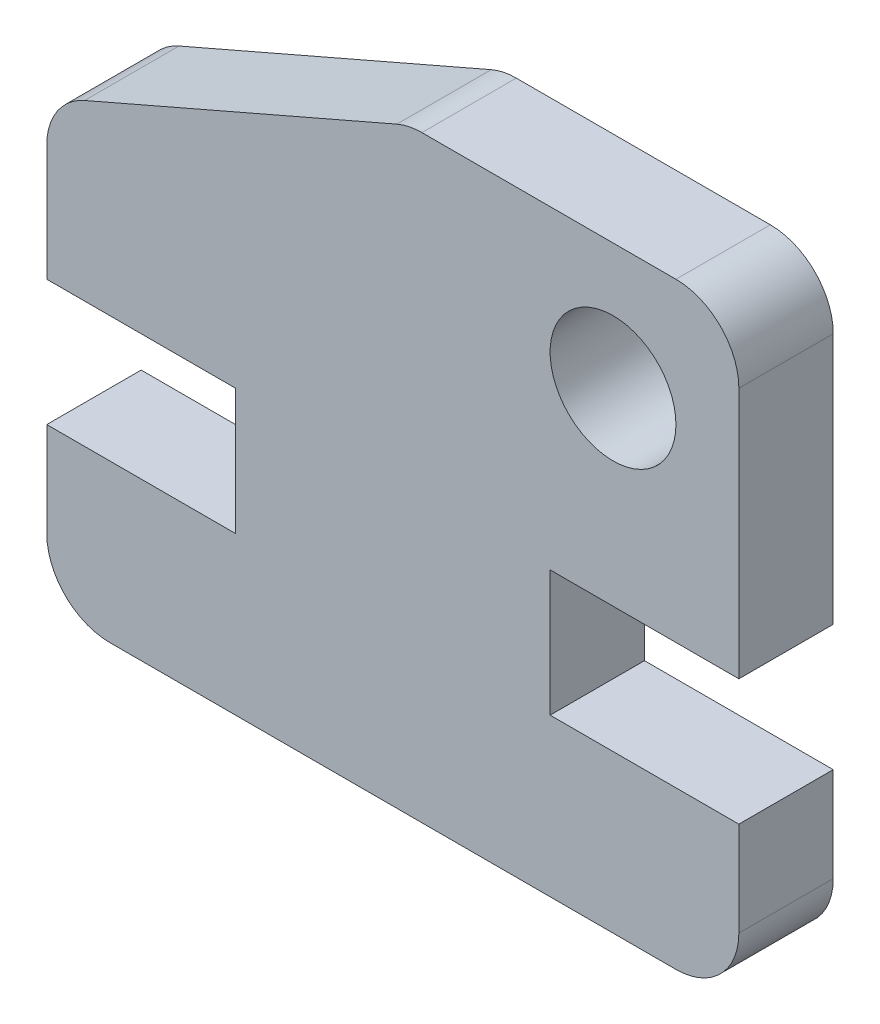
ISO-10303-21;
HEADER;
FILE_DESCRIPTION(('STEP AP214'),'2;1');
FILE_NAME('part.step','',(''),(''),'','','');
FILE_SCHEMA(('AUTOMOTIVE_DESIGN { 1 0 10303 214 1 1 1 1 }'));
ENDSEC;
DATA;
#1=APPLICATION_CONTEXT('core data for automotive mechanical design processes');
#2=APPLICATION_PROTOCOL_DEFINITION('international standard','automotive_design',2000,#1);
#3=PRODUCT_CONTEXT('',#1,'mechanical');
#4=PRODUCT('Part','Part','',(#3));
#5=PRODUCT_RELATED_PRODUCT_CATEGORY('part','',(#4));
#6=PRODUCT_DEFINITION_FORMATION('','',#4);
#7=PRODUCT_DEFINITION_CONTEXT('part definition',#1,'design');
#8=PRODUCT_DEFINITION('design','',#6,#7);
#9=PRODUCT_DEFINITION_SHAPE('','',#8);
#10=(LENGTH_UNIT() NAMED_UNIT(*) SI_UNIT(.MILLI.,.METRE.));
#11=(NAMED_UNIT(*) PLANE_ANGLE_UNIT() SI_UNIT($,.RADIAN.));
#12=(NAMED_UNIT(*) SI_UNIT($,.STERADIAN.) SOLID_ANGLE_UNIT());
#13=UNCERTAINTY_MEASURE_WITH_UNIT(LENGTH_MEASURE(1.E-05),#10,'distance_accuracy_value','');
#14=(GEOMETRIC_REPRESENTATION_CONTEXT(3) GLOBAL_UNCERTAINTY_ASSIGNED_CONTEXT((#13)) GLOBAL_UNIT_ASSIGNED_CONTEXT((#10,
#11,#12)) REPRESENTATION_CONTEXT('',''));
#15=CARTESIAN_POINT('',(0.,0.,0.));
#16=DIRECTION('',(0.,0.,1.));
#17=DIRECTION('',(1.,0.,0.));
#18=AXIS2_PLACEMENT_3D('',#15,#16,#17);
#19=CARTESIAN_POINT('',(-5.,5.,3.));
#20=DIRECTION('',(0.,-1.,0.));
#21=DIRECTION('',(0.,0.,-1.));
#22=AXIS2_PLACEMENT_3D('',#19,#20,#21);
#23=PLANE('',#22);
#24=DIRECTION('',(-1.,0.,0.));
#25=VECTOR('',#24,1.);
#26=CARTESIAN_POINT('',(-5.,5.,0.));
#27=LINE('',#26,#25);
#28=CARTESIAN_POINT('',(-5.,5.,0.));
#29=VERTEX_POINT('',#28);
#30=CARTESIAN_POINT('',(-11.,5.,0.));
#31=VERTEX_POINT('',#30);
#32=EDGE_CURVE('E183',#29,#31,#27,.T.);
#33=ORIENTED_EDGE('',*,*,#32,.T.);
#34=DIRECTION('',(0.,0.,-1.));
#35=VECTOR('',#34,1.);
#36=CARTESIAN_POINT('',(-11.,5.,3.));
#37=LINE('',#36,#35);
#38=CARTESIAN_POINT('',(-11.,5.,3.));
#39=VERTEX_POINT('',#38);
#40=EDGE_CURVE('E162',#39,#31,#37,.T.);
#41=ORIENTED_EDGE('',*,*,#40,.F.);
#42=DIRECTION('',(-1.,0.,0.));
#43=VECTOR('',#42,1.);
#44=CARTESIAN_POINT('',(-5.,5.,3.));
#45=LINE('',#44,#43);
#46=CARTESIAN_POINT('',(-5.,5.,3.));
#47=VERTEX_POINT('',#46);
#48=EDGE_CURVE('E169',#47,#39,#45,.T.);
#49=ORIENTED_EDGE('',*,*,#48,.F.);
#50=DIRECTION('',(0.,0.,-1.));
#51=VECTOR('',#50,1.);
#52=CARTESIAN_POINT('',(-5.,5.,3.));
#53=LINE('',#52,#51);
#54=EDGE_CURVE('E264',#47,#29,#53,.T.);
#55=ORIENTED_EDGE('',*,*,#54,.T.);
#56=EDGE_LOOP('',(#33,#41,#49,#55));
#57=FACE_BOUND('',#56,.T.);
#58=ADVANCED_FACE('F35',(#57),#23,.F.);
#59=CARTESIAN_POINT('',(-11.,5.,3.));
#60=DIRECTION('',(1.,0.,0.));
#61=DIRECTION('',(0.,1.,0.));
#62=AXIS2_PLACEMENT_3D('',#59,#60,#61);
#63=PLANE('',#62);
#64=DIRECTION('',(0.,-1.,0.));
#65=VECTOR('',#64,1.);
#66=CARTESIAN_POINT('',(-11.,5.,0.));
#67=LINE('',#66,#65);
#68=CARTESIAN_POINT('',(-11.,2.,0.));
#69=VERTEX_POINT('',#68);
#70=EDGE_CURVE('E246',#31,#69,#67,.T.);
#71=ORIENTED_EDGE('',*,*,#70,.T.);
#72=DIRECTION('',(0.,0.,-1.));
#73=VECTOR('',#72,1.);
#74=CARTESIAN_POINT('',(-11.,2.,3.));
#75=LINE('',#74,#73);
#76=CARTESIAN_POINT('',(-11.,2.,3.));
#77=VERTEX_POINT('',#76);
#78=EDGE_CURVE('E165',#69,#77,#75,.F.);
#79=ORIENTED_EDGE('',*,*,#78,.T.);
#80=DIRECTION('',(0.,-1.,0.));
#81=VECTOR('',#80,1.);
#82=CARTESIAN_POINT('',(-11.,5.,3.));
#83=LINE('',#82,#81);
#84=EDGE_CURVE('E158',#39,#77,#83,.T.);
#85=ORIENTED_EDGE('',*,*,#84,.F.);
#86=ORIENTED_EDGE('',*,*,#40,.T.);
#87=EDGE_LOOP('',(#71,#79,#85,#86));
#88=FACE_BOUND('',#87,.T.);
#89=ADVANCED_FACE('F160',(#88),#63,.F.);
#90=CARTESIAN_POINT('',(-11.,0.,3.));
#91=DIRECTION('',(0.,1.,0.));
#92=DIRECTION('',(0.,0.,1.));
#93=AXIS2_PLACEMENT_3D('',#90,#91,#92);
#94=PLANE('',#93);
#95=DIRECTION('',(1.,0.,0.));
#96=VECTOR('',#95,1.);
#97=CARTESIAN_POINT('',(-11.,0.,3.));
#98=LINE('',#97,#96);
#99=CARTESIAN_POINT('',(-9.,0.,3.));
#100=VERTEX_POINT('',#99);
#101=CARTESIAN_POINT('',(9.,0.,3.));
#102=VERTEX_POINT('',#101);
#103=EDGE_CURVE('E168',#100,#102,#98,.T.);
#104=ORIENTED_EDGE('',*,*,#103,.F.);
#105=DIRECTION('',(0.,0.,-1.));
#106=VECTOR('',#105,1.);
#107=CARTESIAN_POINT('',(-9.,0.,3.));
#108=LINE('',#107,#106);
#109=CARTESIAN_POINT('',(-9.,0.,0.));
#110=VERTEX_POINT('',#109);
#111=EDGE_CURVE('E224',#100,#110,#108,.T.);
#112=ORIENTED_EDGE('',*,*,#111,.T.);
#113=DIRECTION('',(1.,0.,0.));
#114=VECTOR('',#113,1.);
#115=CARTESIAN_POINT('',(-11.,0.,0.));
#116=LINE('',#115,#114);
#117=CARTESIAN_POINT('',(9.,0.,0.));
#118=VERTEX_POINT('',#117);
#119=EDGE_CURVE('E242',#110,#118,#116,.T.);
#120=ORIENTED_EDGE('',*,*,#119,.T.);
#121=DIRECTION('',(0.,0.,-1.));
#122=VECTOR('',#121,1.);
#123=CARTESIAN_POINT('',(9.,0.,3.));
#124=LINE('',#123,#122);
#125=EDGE_CURVE('E222',#118,#102,#124,.F.);
#126=ORIENTED_EDGE('',*,*,#125,.T.);
#127=EDGE_LOOP('',(#104,#112,#120,#126));
#128=FACE_BOUND('',#127,.T.);
#129=ADVANCED_FACE('F318',(#128),#94,.F.);
#130=CARTESIAN_POINT('',(11.,5.,3.));
#131=DIRECTION('',(-1.,0.,0.));
#132=DIRECTION('',(0.,-1.,0.));
#133=AXIS2_PLACEMENT_3D('',#130,#131,#132);
#134=PLANE('',#133);
#135=DIRECTION('',(0.,1.,0.));
#136=VECTOR('',#135,1.);
#137=CARTESIAN_POINT('',(11.,5.,3.));
#138=LINE('',#137,#136);
#139=CARTESIAN_POINT('',(11.,2.,3.));
#140=VERTEX_POINT('',#139);
#141=CARTESIAN_POINT('',(11.,5.,3.));
#142=VERTEX_POINT('',#141);
#143=EDGE_CURVE('E234',#140,#142,#138,.T.);
#144=ORIENTED_EDGE('',*,*,#143,.F.);
#145=DIRECTION('',(0.,0.,-1.));
#146=VECTOR('',#145,1.);
#147=CARTESIAN_POINT('',(11.,2.,3.));
#148=LINE('',#147,#146);
#149=CARTESIAN_POINT('',(11.,2.,0.));
#150=VERTEX_POINT('',#149);
#151=EDGE_CURVE('E43',#140,#150,#148,.T.);
#152=ORIENTED_EDGE('',*,*,#151,.T.);
#153=DIRECTION('',(0.,1.,0.));
#154=VECTOR('',#153,1.);
#155=CARTESIAN_POINT('',(11.,5.,0.));
#156=LINE('',#155,#154);
#157=CARTESIAN_POINT('',(11.,5.,0.));
#158=VERTEX_POINT('',#157);
#159=EDGE_CURVE('E233',#150,#158,#156,.T.);
#160=ORIENTED_EDGE('',*,*,#159,.T.);
#161=DIRECTION('',(0.,0.,-1.));
#162=VECTOR('',#161,1.);
#163=CARTESIAN_POINT('',(11.,5.,3.));
#164=LINE('',#163,#162);
#165=EDGE_CURVE('E185',#142,#158,#164,.T.);
#166=ORIENTED_EDGE('',*,*,#165,.F.);
#167=EDGE_LOOP('',(#144,#152,#160,#166));
#168=FACE_BOUND('',#167,.T.);
#169=ADVANCED_FACE('F231',(#168),#134,.F.);
#170=CARTESIAN_POINT('',(5.,5.,3.));
#171=DIRECTION('',(0.,-1.,0.));
#172=DIRECTION('',(0.,0.,-1.));
#173=AXIS2_PLACEMENT_3D('',#170,#171,#172);
#174=PLANE('',#173);
#175=DIRECTION('',(-1.,0.,0.));
#176=VECTOR('',#175,1.);
#177=CARTESIAN_POINT('',(5.,5.,0.));
#178=LINE('',#177,#176);
#179=CARTESIAN_POINT('',(5.,5.,0.));
#180=VERTEX_POINT('',#179);
#181=EDGE_CURVE('E241',#158,#180,#178,.T.);
#182=ORIENTED_EDGE('',*,*,#181,.T.);
#183=DIRECTION('',(0.,0.,-1.));
#184=VECTOR('',#183,1.);
#185=CARTESIAN_POINT('',(5.,5.,3.));
#186=LINE('',#185,#184);
#187=CARTESIAN_POINT('',(5.,5.,3.));
#188=VERTEX_POINT('',#187);
#189=EDGE_CURVE('E191',#188,#180,#186,.T.);
#190=ORIENTED_EDGE('',*,*,#189,.F.);
#191=DIRECTION('',(-1.,0.,0.));
#192=VECTOR('',#191,1.);
#193=CARTESIAN_POINT('',(5.,5.,3.));
#194=LINE('',#193,#192);
#195=EDGE_CURVE('E321',#142,#188,#194,.T.);
#196=ORIENTED_EDGE('',*,*,#195,.F.);
#197=ORIENTED_EDGE('',*,*,#165,.T.);
#198=EDGE_LOOP('',(#182,#190,#196,#197));
#199=FACE_BOUND('',#198,.T.);
#200=ADVANCED_FACE('F324',(#199),#174,.F.);
#201=CARTESIAN_POINT('',(5.,9.,3.));
#202=DIRECTION('',(-1.,0.,0.));
#203=DIRECTION('',(0.,0.,1.));
#204=AXIS2_PLACEMENT_3D('',#201,#202,#203);
#205=PLANE('',#204);
#206=DIRECTION('',(0.,1.,0.));
#207=VECTOR('',#206,1.);
#208=CARTESIAN_POINT('',(5.,9.,0.));
#209=LINE('',#208,#207);
#210=CARTESIAN_POINT('',(5.,9.,0.));
#211=VERTEX_POINT('',#210);
#212=EDGE_CURVE('E244',#180,#211,#209,.T.);
#213=ORIENTED_EDGE('',*,*,#212,.T.);
#214=DIRECTION('',(0.,0.,-1.));
#215=VECTOR('',#214,1.);
#216=CARTESIAN_POINT('',(5.,9.,3.));
#217=LINE('',#216,#215);
#218=CARTESIAN_POINT('',(5.,9.,3.));
#219=VERTEX_POINT('',#218);
#220=EDGE_CURVE('E275',#219,#211,#217,.T.);
#221=ORIENTED_EDGE('',*,*,#220,.F.);
#222=DIRECTION('',(0.,1.,0.));
#223=VECTOR('',#222,1.);
#224=CARTESIAN_POINT('',(5.,9.,3.));
#225=LINE('',#224,#223);
#226=EDGE_CURVE('E283',#188,#219,#225,.T.);
#227=ORIENTED_EDGE('',*,*,#226,.F.);
#228=ORIENTED_EDGE('',*,*,#189,.T.);
#229=EDGE_LOOP('',(#213,#221,#227,#228));
#230=FACE_BOUND('',#229,.T.);
#231=ADVANCED_FACE('F281',(#230),#205,.F.);
#232=CARTESIAN_POINT('',(5.,9.,3.));
#233=DIRECTION('',(0.,1.,0.));
#234=DIRECTION('',(0.,0.,1.));
#235=AXIS2_PLACEMENT_3D('',#232,#233,#234);
#236=PLANE('',#235);
#237=DIRECTION('',(1.,0.,0.));
#238=VECTOR('',#237,1.);
#239=CARTESIAN_POINT('',(5.,9.,0.));
#240=LINE('',#239,#238);
#241=CARTESIAN_POINT('',(11.,9.,0.));
#242=VERTEX_POINT('',#241);
#243=EDGE_CURVE('E251',#211,#242,#240,.T.);
#244=ORIENTED_EDGE('',*,*,#243,.T.);
#245=DIRECTION('',(0.,0.,-1.));
#246=VECTOR('',#245,1.);
#247=CARTESIAN_POINT('',(11.,9.,3.));
#248=LINE('',#247,#246);
#249=CARTESIAN_POINT('',(11.,9.,3.));
#250=VERTEX_POINT('',#249);
#251=EDGE_CURVE('E272',#250,#242,#248,.T.);
#252=ORIENTED_EDGE('',*,*,#251,.F.);
#253=DIRECTION('',(1.,0.,0.));
#254=VECTOR('',#253,1.);
#255=CARTESIAN_POINT('',(5.,9.,3.));
#256=LINE('',#255,#254);
#257=EDGE_CURVE('E300',#219,#250,#256,.T.);
#258=ORIENTED_EDGE('',*,*,#257,.F.);
#259=ORIENTED_EDGE('',*,*,#220,.T.);
#260=EDGE_LOOP('',(#244,#252,#258,#259));
#261=FACE_BOUND('',#260,.T.);
#262=ADVANCED_FACE('F290',(#261),#236,.F.);
#263=CARTESIAN_POINT('',(11.,19.,3.));
#264=DIRECTION('',(-1.,0.,0.));
#265=DIRECTION('',(0.,0.,1.));
#266=AXIS2_PLACEMENT_3D('',#263,#264,#265);
#267=PLANE('',#266);
#268=DIRECTION('',(0.,1.,0.));
#269=VECTOR('',#268,1.);
#270=CARTESIAN_POINT('',(11.,19.,0.));
#271=LINE('',#270,#269);
#272=CARTESIAN_POINT('',(11.,17.,0.));
#273=VERTEX_POINT('',#272);
#274=EDGE_CURVE('E253',#242,#273,#271,.T.);
#275=ORIENTED_EDGE('',*,*,#274,.T.);
#276=DIRECTION('',(0.,0.,-1.));
#277=VECTOR('',#276,1.);
#278=CARTESIAN_POINT('',(11.,17.,3.));
#279=LINE('',#278,#277);
#280=CARTESIAN_POINT('',(11.,17.,3.));
#281=VERTEX_POINT('',#280);
#282=EDGE_CURVE('E11',#273,#281,#279,.F.);
#283=ORIENTED_EDGE('',*,*,#282,.T.);
#284=DIRECTION('',(0.,1.,0.));
#285=VECTOR('',#284,1.);
#286=CARTESIAN_POINT('',(11.,19.,3.));
#287=LINE('',#286,#285);
#288=EDGE_CURVE('E297',#250,#281,#287,.T.);
#289=ORIENTED_EDGE('',*,*,#288,.F.);
#290=ORIENTED_EDGE('',*,*,#251,.T.);
#291=EDGE_LOOP('',(#275,#283,#289,#290));
#292=FACE_BOUND('',#291,.T.);
#293=ADVANCED_FACE('F294',(#292),#267,.F.);
#294=CARTESIAN_POINT('',(-11.,19.,3.));
#295=DIRECTION('',(0.,-1.,0.));
#296=DIRECTION('',(0.,0.,-1.));
#297=AXIS2_PLACEMENT_3D('',#294,#295,#296);
#298=PLANE('',#297);
#299=DIRECTION('',(-1.,0.,0.));
#300=VECTOR('',#299,1.);
#301=CARTESIAN_POINT('',(-11.,19.,0.));
#302=LINE('',#301,#300);
#303=CARTESIAN_POINT('',(9.,19.,0.));
#304=VERTEX_POINT('',#303);
#305=CARTESIAN_POINT('',(0.92509029243301,19.,0.));
#306=VERTEX_POINT('',#305);
#307=EDGE_CURVE('E256',#304,#306,#302,.T.);
#308=ORIENTED_EDGE('',*,*,#307,.T.);
#309=DIRECTION('',(0.,0.,1.));
#310=VECTOR('',#309,1.);
#311=CARTESIAN_POINT('',(0.92509029243301,19.,3.));
#312=LINE('',#311,#310);
#313=CARTESIAN_POINT('',(0.92509029243301,19.,3.));
#314=VERTEX_POINT('',#313);
#315=EDGE_CURVE('E188',#306,#314,#312,.T.);
#316=ORIENTED_EDGE('',*,*,#315,.T.);
#317=DIRECTION('',(-1.,0.,0.));
#318=VECTOR('',#317,1.);
#319=CARTESIAN_POINT('',(-11.,19.,3.));
#320=LINE('',#319,#318);
#321=CARTESIAN_POINT('',(9.,19.,3.));
#322=VERTEX_POINT('',#321);
#323=EDGE_CURVE('E299',#322,#314,#320,.T.);
#324=ORIENTED_EDGE('',*,*,#323,.F.);
#325=DIRECTION('',(0.,0.,-1.));
#326=VECTOR('',#325,1.);
#327=CARTESIAN_POINT('',(9.,19.,3.));
#328=LINE('',#327,#326);
#329=EDGE_CURVE('E184',#322,#304,#328,.T.);
#330=ORIENTED_EDGE('',*,*,#329,.T.);
#331=EDGE_LOOP('',(#308,#316,#324,#330));
#332=FACE_BOUND('',#331,.T.);
#333=ADVANCED_FACE('F362',(#332),#298,.F.);
#334=CARTESIAN_POINT('',(-11.,19.,3.));
#335=DIRECTION('',(1.,0.,0.));
#336=DIRECTION('',(0.,0.,-1.));
#337=AXIS2_PLACEMENT_3D('',#334,#335,#336);
#338=PLANE('',#337);
#339=DIRECTION('',(0.,-1.,0.));
#340=VECTOR('',#339,1.);
#341=CARTESIAN_POINT('',(-11.,19.,3.));
#342=LINE('',#341,#340);
#343=CARTESIAN_POINT('',(-11.,12.6882783413713,3.));
#344=VERTEX_POINT('',#343);
#345=CARTESIAN_POINT('',(-11.,9.,3.));
#346=VERTEX_POINT('',#345);
#347=EDGE_CURVE('E302',#344,#346,#342,.T.);
#348=ORIENTED_EDGE('',*,*,#347,.F.);
#349=DIRECTION('',(0.,0.,1.));
#350=VECTOR('',#349,1.);
#351=CARTESIAN_POINT('',(-11.,12.6882783413713,3.));
#352=LINE('',#351,#350);
#353=CARTESIAN_POINT('',(-11.,12.6882783413713,0.));
#354=VERTEX_POINT('',#353);
#355=EDGE_CURVE('E220',#344,#354,#352,.F.);
#356=ORIENTED_EDGE('',*,*,#355,.T.);
#357=DIRECTION('',(0.,-1.,0.));
#358=VECTOR('',#357,1.);
#359=CARTESIAN_POINT('',(-11.,19.,0.));
#360=LINE('',#359,#358);
#361=CARTESIAN_POINT('',(-11.,9.,0.));
#362=VERTEX_POINT('',#361);
#363=EDGE_CURVE('E259',#354,#362,#360,.T.);
#364=ORIENTED_EDGE('',*,*,#363,.T.);
#365=DIRECTION('',(0.,0.,-1.));
#366=VECTOR('',#365,1.);
#367=CARTESIAN_POINT('',(-11.,9.,3.));
#368=LINE('',#367,#366);
#369=EDGE_CURVE('E269',#346,#362,#368,.T.);
#370=ORIENTED_EDGE('',*,*,#369,.F.);
#371=EDGE_LOOP('',(#348,#356,#364,#370));
#372=FACE_BOUND('',#371,.T.);
#373=ADVANCED_FACE('F404',(#372),#338,.F.);
#374=CARTESIAN_POINT('',(-5.,9.,3.));
#375=DIRECTION('',(0.,1.,0.));
#376=DIRECTION('',(0.,0.,1.));
#377=AXIS2_PLACEMENT_3D('',#374,#375,#376);
#378=PLANE('',#377);
#379=DIRECTION('',(1.,0.,0.));
#380=VECTOR('',#379,1.);
#381=CARTESIAN_POINT('',(-5.,9.,0.));
#382=LINE('',#381,#380);
#383=CARTESIAN_POINT('',(-5.,9.,0.));
#384=VERTEX_POINT('',#383);
#385=EDGE_CURVE('E261',#362,#384,#382,.T.);
#386=ORIENTED_EDGE('',*,*,#385,.T.);
#387=DIRECTION('',(0.,0.,-1.));
#388=VECTOR('',#387,1.);
#389=CARTESIAN_POINT('',(-5.,9.,3.));
#390=LINE('',#389,#388);
#391=CARTESIAN_POINT('',(-5.,9.,3.));
#392=VERTEX_POINT('',#391);
#393=EDGE_CURVE('E266',#392,#384,#390,.T.);
#394=ORIENTED_EDGE('',*,*,#393,.F.);
#395=DIRECTION('',(1.,0.,0.));
#396=VECTOR('',#395,1.);
#397=CARTESIAN_POINT('',(-5.,9.,3.));
#398=LINE('',#397,#396);
#399=EDGE_CURVE('E308',#346,#392,#398,.T.);
#400=ORIENTED_EDGE('',*,*,#399,.F.);
#401=ORIENTED_EDGE('',*,*,#369,.T.);
#402=EDGE_LOOP('',(#386,#394,#400,#401));
#403=FACE_BOUND('',#402,.T.);
#404=ADVANCED_FACE('F397',(#403),#378,.F.);
#405=CARTESIAN_POINT('',(-5.,9.,3.));
#406=DIRECTION('',(1.,0.,0.));
#407=DIRECTION('',(0.,1.,0.));
#408=AXIS2_PLACEMENT_3D('',#405,#406,#407);
#409=PLANE('',#408);
#410=DIRECTION('',(0.,-1.,0.));
#411=VECTOR('',#410,1.);
#412=CARTESIAN_POINT('',(-5.,9.,0.));
#413=LINE('',#412,#411);
#414=EDGE_CURVE('E180',#384,#29,#413,.T.);
#415=ORIENTED_EDGE('',*,*,#414,.T.);
#416=ORIENTED_EDGE('',*,*,#54,.F.);
#417=DIRECTION('',(0.,-1.,0.));
#418=VECTOR('',#417,1.);
#419=CARTESIAN_POINT('',(-5.,9.,3.));
#420=LINE('',#419,#418);
#421=EDGE_CURVE('E176',#392,#47,#420,.T.);
#422=ORIENTED_EDGE('',*,*,#421,.F.);
#423=ORIENTED_EDGE('',*,*,#393,.T.);
#424=EDGE_LOOP('',(#415,#416,#422,#423));
#425=FACE_BOUND('',#424,.T.);
#426=ADVANCED_FACE('F390',(#425),#409,.F.);
#427=CARTESIAN_POINT('',(0.,0.,3.));
#428=DIRECTION('',(0.,0.,1.));
#429=DIRECTION('',(1.,0.,0.));
#430=AXIS2_PLACEMENT_3D('',#427,#428,#429);
#431=PLANE('',#430);
#432=ORIENTED_EDGE('',*,*,#323,.T.);
#433=CARTESIAN_POINT('',(0.92509029243301,17.,3.));
#434=DIRECTION('',(0.,0.,1.));
#435=DIRECTION('',(1.,0.,0.));
#436=AXIS2_PLACEMENT_3D('',#433,#434,#435);
#437=CIRCLE('',#436,2.);
#438=CARTESIAN_POINT('',(0.128187580259592,18.8343789323176,3.));
#439=VERTEX_POINT('',#438);
#440=EDGE_CURVE('E205',#314,#439,#437,.T.);
#441=ORIENTED_EDGE('',*,*,#440,.T.);
#442=DIRECTION('',(0.917189466158799,0.39845135608671,0.));
#443=VECTOR('',#442,1.);
#444=CARTESIAN_POINT('',(-11.,14.,3.));
#445=LINE('',#444,#443);
#446=CARTESIAN_POINT('',(-9.79690271217342,14.5226572736889,3.));
#447=VERTEX_POINT('',#446);
#448=EDGE_CURVE('E369',#447,#439,#445,.T.);
#449=ORIENTED_EDGE('',*,*,#448,.F.);
#450=CARTESIAN_POINT('',(-9.,12.6882783413713,3.));
#451=DIRECTION('',(0.,0.,1.));
#452=DIRECTION('',(1.,0.,0.));
#453=AXIS2_PLACEMENT_3D('',#450,#451,#452);
#454=CIRCLE('',#453,2.);
#455=EDGE_CURVE('E203',#447,#344,#454,.T.);
#456=ORIENTED_EDGE('',*,*,#455,.T.);
#457=ORIENTED_EDGE('',*,*,#347,.T.);
#458=ORIENTED_EDGE('',*,*,#399,.T.);
#459=ORIENTED_EDGE('',*,*,#421,.T.);
#460=ORIENTED_EDGE('',*,*,#48,.T.);
#461=ORIENTED_EDGE('',*,*,#84,.T.);
#462=CARTESIAN_POINT('',(-9.,2.,3.));
#463=DIRECTION('',(0.,0.,1.));
#464=DIRECTION('',(1.,0.,0.));
#465=AXIS2_PLACEMENT_3D('',#462,#463,#464);
#466=CIRCLE('',#465,2.);
#467=EDGE_CURVE('E201',#77,#100,#466,.T.);
#468=ORIENTED_EDGE('',*,*,#467,.T.);
#469=ORIENTED_EDGE('',*,*,#103,.T.);
#470=CARTESIAN_POINT('',(9.,2.,3.));
#471=DIRECTION('',(0.,0.,1.));
#472=DIRECTION('',(1.,0.,0.));
#473=AXIS2_PLACEMENT_3D('',#470,#471,#472);
#474=CIRCLE('',#473,2.);
#475=EDGE_CURVE('E199',#102,#140,#474,.T.);
#476=ORIENTED_EDGE('',*,*,#475,.T.);
#477=ORIENTED_EDGE('',*,*,#143,.T.);
#478=ORIENTED_EDGE('',*,*,#195,.T.);
#479=ORIENTED_EDGE('',*,*,#226,.T.);
#480=ORIENTED_EDGE('',*,*,#257,.T.);
#481=ORIENTED_EDGE('',*,*,#288,.T.);
#482=CARTESIAN_POINT('',(9.,17.,3.));
#483=DIRECTION('',(0.,0.,1.));
#484=DIRECTION('',(1.,0.,0.));
#485=AXIS2_PLACEMENT_3D('',#482,#483,#484);
#486=CIRCLE('',#485,2.);
#487=EDGE_CURVE('E197',#281,#322,#486,.T.);
#488=ORIENTED_EDGE('',*,*,#487,.T.);
#489=EDGE_LOOP('',(#432,#441,#449,#456,#457,#458,#459,#460,#461,#468,#469,#476,#477,#478,#479,
#480,#481,#488));
#490=FACE_BOUND('',#489,.T.);
#491=CARTESIAN_POINT('',(7.,15.,3.));
#492=DIRECTION('',(0.,0.,1.));
#493=DIRECTION('',(1.,0.,0.));
#494=AXIS2_PLACEMENT_3D('',#491,#492,#493);
#495=CIRCLE('',#494,1.99999999999999);
#496=CARTESIAN_POINT('',(8.99999999999999,15.,3.));
#497=VERTEX_POINT('',#496);
#498=EDGE_CURVE('E375',#497,#497,#495,.T.);
#499=ORIENTED_EDGE('',*,*,#498,.F.);
#500=EDGE_LOOP('',(#499));
#501=FACE_BOUND('',#500,.T.);
#502=ADVANCED_FACE('F173',(#490,#501),#431,.T.);
#503=CARTESIAN_POINT('',(0.,0.,0.));
#504=DIRECTION('',(0.,0.,1.));
#505=DIRECTION('',(1.,0.,0.));
#506=AXIS2_PLACEMENT_3D('',#503,#504,#505);
#507=PLANE('',#506);
#508=CARTESIAN_POINT('',(7.,15.,0.));
#509=DIRECTION('',(0.,0.,1.));
#510=DIRECTION('',(1.,0.,0.));
#511=AXIS2_PLACEMENT_3D('',#508,#509,#510);
#512=CIRCLE('',#511,2.);
#513=CARTESIAN_POINT('',(9.,15.,0.));
#514=VERTEX_POINT('',#513);
#515=EDGE_CURVE('E311',#514,#514,#512,.T.);
#516=ORIENTED_EDGE('',*,*,#515,.T.);
#517=EDGE_LOOP('',(#516));
#518=FACE_BOUND('',#517,.T.);
#519=DIRECTION('',(0.917189466158799,0.39845135608671,0.));
#520=VECTOR('',#519,1.);
#521=CARTESIAN_POINT('',(-11.,14.,0.));
#522=LINE('',#521,#520);
#523=CARTESIAN_POINT('',(-9.79690271217342,14.5226572736889,0.));
#524=VERTEX_POINT('',#523);
#525=CARTESIAN_POINT('',(0.128187580259592,18.8343789323176,0.));
#526=VERTEX_POINT('',#525);
#527=EDGE_CURVE('E373',#524,#526,#522,.T.);
#528=ORIENTED_EDGE('',*,*,#527,.T.);
#529=CARTESIAN_POINT('',(0.92509029243301,17.,0.));
#530=DIRECTION('',(0.,0.,1.));
#531=DIRECTION('',(1.,0.,0.));
#532=AXIS2_PLACEMENT_3D('',#529,#530,#531);
#533=CIRCLE('',#532,2.);
#534=EDGE_CURVE('E218',#526,#306,#533,.F.);
#535=ORIENTED_EDGE('',*,*,#534,.T.);
#536=ORIENTED_EDGE('',*,*,#307,.F.);
#537=CARTESIAN_POINT('',(9.,17.,0.));
#538=DIRECTION('',(0.,0.,1.));
#539=DIRECTION('',(1.,0.,0.));
#540=AXIS2_PLACEMENT_3D('',#537,#538,#539);
#541=CIRCLE('',#540,2.);
#542=EDGE_CURVE('E212',#304,#273,#541,.F.);
#543=ORIENTED_EDGE('',*,*,#542,.T.);
#544=ORIENTED_EDGE('',*,*,#274,.F.);
#545=ORIENTED_EDGE('',*,*,#243,.F.);
#546=ORIENTED_EDGE('',*,*,#212,.F.);
#547=ORIENTED_EDGE('',*,*,#181,.F.);
#548=ORIENTED_EDGE('',*,*,#159,.F.);
#549=CARTESIAN_POINT('',(9.,2.,0.));
#550=DIRECTION('',(0.,0.,1.));
#551=DIRECTION('',(1.,0.,0.));
#552=AXIS2_PLACEMENT_3D('',#549,#550,#551);
#553=CIRCLE('',#552,2.);
#554=EDGE_CURVE('E56',#150,#118,#553,.F.);
#555=ORIENTED_EDGE('',*,*,#554,.T.);
#556=ORIENTED_EDGE('',*,*,#119,.F.);
#557=CARTESIAN_POINT('',(-9.,2.,0.));
#558=DIRECTION('',(0.,0.,1.));
#559=DIRECTION('',(1.,0.,0.));
#560=AXIS2_PLACEMENT_3D('',#557,#558,#559);
#561=CIRCLE('',#560,2.);
#562=EDGE_CURVE('E50',#110,#69,#561,.F.);
#563=ORIENTED_EDGE('',*,*,#562,.T.);
#564=ORIENTED_EDGE('',*,*,#70,.F.);
#565=ORIENTED_EDGE('',*,*,#32,.F.);
#566=ORIENTED_EDGE('',*,*,#414,.F.);
#567=ORIENTED_EDGE('',*,*,#385,.F.);
#568=ORIENTED_EDGE('',*,*,#363,.F.);
#569=CARTESIAN_POINT('',(-9.,12.6882783413713,0.));
#570=DIRECTION('',(0.,0.,1.));
#571=DIRECTION('',(1.,0.,0.));
#572=AXIS2_PLACEMENT_3D('',#569,#570,#571);
#573=CIRCLE('',#572,2.);
#574=EDGE_CURVE('E216',#354,#524,#573,.F.);
#575=ORIENTED_EDGE('',*,*,#574,.T.);
#576=EDGE_LOOP('',(#528,#535,#536,#543,#544,#545,#546,#547,#548,#555,#556,#563,#564,#565,#566,
#567,#568,#575));
#577=FACE_BOUND('',#576,.T.);
#578=ADVANCED_FACE('F239',(#518,#577),#507,.F.);
#579=CARTESIAN_POINT('',(7.,15.,3.));
#580=DIRECTION('',(0.,0.,1.));
#581=DIRECTION('',(1.,0.,0.));
#582=AXIS2_PLACEMENT_3D('',#579,#580,#581);
#583=CYLINDRICAL_SURFACE('',#582,1.99999999999999);
#584=ORIENTED_EDGE('',*,*,#515,.F.);
#585=EDGE_LOOP('',(#584));
#586=FACE_BOUND('',#585,.T.);
#587=ORIENTED_EDGE('',*,*,#498,.T.);
#588=EDGE_LOOP('',(#587));
#589=FACE_BOUND('',#588,.T.);
#590=ADVANCED_FACE('F384',(#586,#589),#583,.F.);
#591=CARTESIAN_POINT('',(-11.,14.,0.));
#592=DIRECTION('',(0.39845135608671,-0.917189466158798,0.));
#593=DIRECTION('',(0.917189466158799,0.39845135608671,0.));
#594=AXIS2_PLACEMENT_3D('',#591,#592,#593);
#595=PLANE('',#594);
#596=ORIENTED_EDGE('',*,*,#448,.T.);
#597=DIRECTION('',(0.,0.,1.));
#598=VECTOR('',#597,1.);
#599=CARTESIAN_POINT('',(0.12818758025959,18.8343789323176,0.));
#600=LINE('',#599,#598);
#601=EDGE_CURVE('E210',#439,#526,#600,.F.);
#602=ORIENTED_EDGE('',*,*,#601,.T.);
#603=ORIENTED_EDGE('',*,*,#527,.F.);
#604=DIRECTION('',(0.,0.,1.));
#605=VECTOR('',#604,1.);
#606=CARTESIAN_POINT('',(-9.79690271217342,14.5226572736889,0.));
#607=LINE('',#606,#605);
#608=EDGE_CURVE('E207',#524,#447,#607,.T.);
#609=ORIENTED_EDGE('',*,*,#608,.T.);
#610=EDGE_LOOP('',(#596,#602,#603,#609));
#611=FACE_BOUND('',#610,.T.);
#612=ADVANCED_FACE('F345',(#611),#595,.F.);
#613=CARTESIAN_POINT('',(0.92509029243301,17.,3.));
#614=DIRECTION('',(0.,0.,1.));
#615=DIRECTION('',(1.,0.,0.));
#616=AXIS2_PLACEMENT_3D('',#613,#614,#615);
#617=CYLINDRICAL_SURFACE('',#616,2.);
#618=ORIENTED_EDGE('',*,*,#534,.F.);
#619=ORIENTED_EDGE('',*,*,#601,.F.);
#620=ORIENTED_EDGE('',*,*,#440,.F.);
#621=ORIENTED_EDGE('',*,*,#315,.F.);
#622=EDGE_LOOP('',(#618,#619,#620,#621));
#623=FACE_BOUND('',#622,.T.);
#624=ADVANCED_FACE('F341',(#623),#617,.T.);
#625=CARTESIAN_POINT('',(-9.,12.6882783413713,0.));
#626=DIRECTION('',(0.,0.,1.));
#627=DIRECTION('',(1.,0.,0.));
#628=AXIS2_PLACEMENT_3D('',#625,#626,#627);
#629=CYLINDRICAL_SURFACE('',#628,2.);
#630=ORIENTED_EDGE('',*,*,#574,.F.);
#631=ORIENTED_EDGE('',*,*,#355,.F.);
#632=ORIENTED_EDGE('',*,*,#455,.F.);
#633=ORIENTED_EDGE('',*,*,#608,.F.);
#634=EDGE_LOOP('',(#630,#631,#632,#633));
#635=FACE_BOUND('',#634,.T.);
#636=ADVANCED_FACE('F344',(#635),#629,.T.);
#637=CARTESIAN_POINT('',(-9.,2.,3.));
#638=DIRECTION('',(0.,0.,-1.));
#639=DIRECTION('',(-1.,0.,0.));
#640=AXIS2_PLACEMENT_3D('',#637,#638,#639);
#641=CYLINDRICAL_SURFACE('',#640,2.);
#642=ORIENTED_EDGE('',*,*,#467,.F.);
#643=ORIENTED_EDGE('',*,*,#78,.F.);
#644=ORIENTED_EDGE('',*,*,#562,.F.);
#645=ORIENTED_EDGE('',*,*,#111,.F.);
#646=EDGE_LOOP('',(#642,#643,#644,#645));
#647=FACE_BOUND('',#646,.T.);
#648=ADVANCED_FACE('F313',(#647),#641,.T.);
#649=CARTESIAN_POINT('',(9.,2.,3.));
#650=DIRECTION('',(0.,0.,-1.));
#651=DIRECTION('',(-1.,0.,0.));
#652=AXIS2_PLACEMENT_3D('',#649,#650,#651);
#653=CYLINDRICAL_SURFACE('',#652,2.);
#654=ORIENTED_EDGE('',*,*,#475,.F.);
#655=ORIENTED_EDGE('',*,*,#125,.F.);
#656=ORIENTED_EDGE('',*,*,#554,.F.);
#657=ORIENTED_EDGE('',*,*,#151,.F.);
#658=EDGE_LOOP('',(#654,#655,#656,#657));
#659=FACE_BOUND('',#658,.T.);
#660=ADVANCED_FACE('F351',(#659),#653,.T.);
#661=CARTESIAN_POINT('',(9.,17.,3.));
#662=DIRECTION('',(0.,0.,-1.));
#663=DIRECTION('',(-1.,0.,0.));
#664=AXIS2_PLACEMENT_3D('',#661,#662,#663);
#665=CYLINDRICAL_SURFACE('',#664,2.);
#666=ORIENTED_EDGE('',*,*,#487,.F.);
#667=ORIENTED_EDGE('',*,*,#282,.F.);
#668=ORIENTED_EDGE('',*,*,#542,.F.);
#669=ORIENTED_EDGE('',*,*,#329,.F.);
#670=EDGE_LOOP('',(#666,#667,#668,#669));
#671=FACE_BOUND('',#670,.T.);
#672=ADVANCED_FACE('F37',(#671),#665,.T.);
#673=CLOSED_SHELL('',(#58,#89,#129,#169,#200,#231,#262,#293,#333,#373,#404,#426,#502,#578,#590,
#612,#624,#636,#648,#660,#672));
#674=MANIFOLD_SOLID_BREP('B2',#673);
#675=ADVANCED_BREP_SHAPE_REPRESENTATION('',(#18,#674),#14);
#676=SHAPE_DEFINITION_REPRESENTATION(#9,#675);
ENDSEC;
END-ISO-10303-21;
